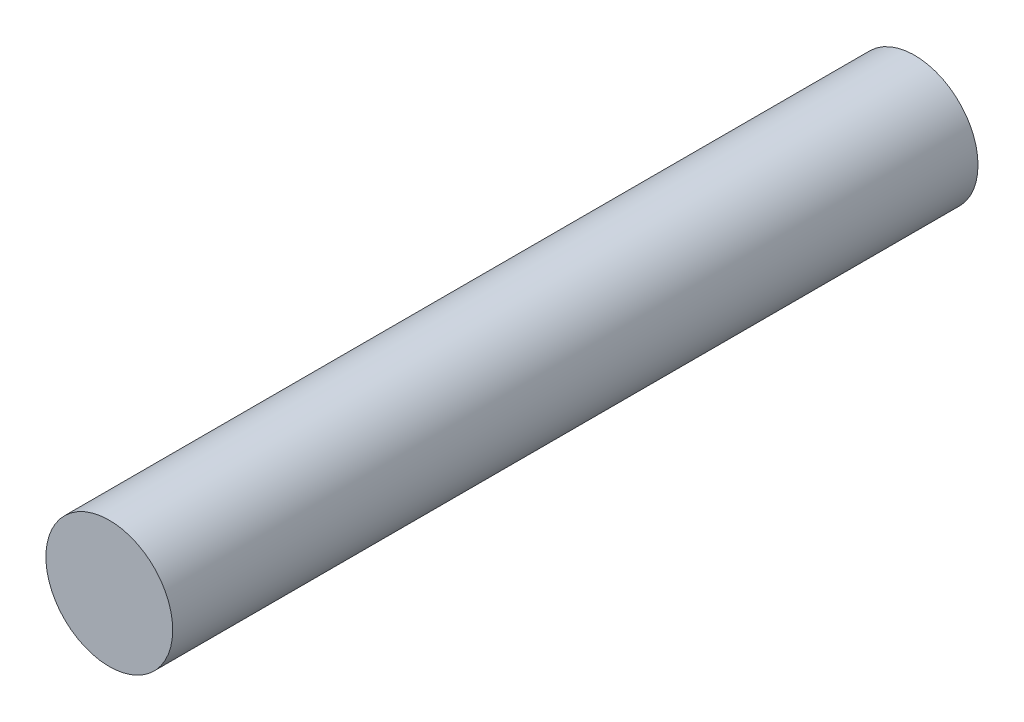
ISO-10303-21;
HEADER;
FILE_DESCRIPTION(('STEP AP214'),'2;1');
FILE_NAME('part.step','',(''),(''),'','','');
FILE_SCHEMA(('AUTOMOTIVE_DESIGN { 1 0 10303 214 1 1 1 1 }'));
ENDSEC;
DATA;
#1=APPLICATION_CONTEXT('core data for automotive mechanical design processes');
#2=APPLICATION_PROTOCOL_DEFINITION('international standard','automotive_design',2000,#1);
#3=PRODUCT_CONTEXT('',#1,'mechanical');
#4=PRODUCT('Part','Part','',(#3));
#5=PRODUCT_RELATED_PRODUCT_CATEGORY('part','',(#4));
#6=PRODUCT_DEFINITION_FORMATION('','',#4);
#7=PRODUCT_DEFINITION_CONTEXT('part definition',#1,'design');
#8=PRODUCT_DEFINITION('design','',#6,#7);
#9=PRODUCT_DEFINITION_SHAPE('','',#8);
#10=(LENGTH_UNIT() NAMED_UNIT(*) SI_UNIT(.MILLI.,.METRE.));
#11=(NAMED_UNIT(*) PLANE_ANGLE_UNIT() SI_UNIT($,.RADIAN.));
#12=(NAMED_UNIT(*) SI_UNIT($,.STERADIAN.) SOLID_ANGLE_UNIT());
#13=UNCERTAINTY_MEASURE_WITH_UNIT(LENGTH_MEASURE(1.E-05),#10,'distance_accuracy_value','');
#14=(GEOMETRIC_REPRESENTATION_CONTEXT(3) GLOBAL_UNCERTAINTY_ASSIGNED_CONTEXT((#13)) GLOBAL_UNIT_ASSIGNED_CONTEXT((#10,
#11,#12)) REPRESENTATION_CONTEXT('',''));
#15=CARTESIAN_POINT('',(0.,0.,0.));
#16=DIRECTION('',(0.,0.,1.));
#17=DIRECTION('',(1.,0.,0.));
#18=AXIS2_PLACEMENT_3D('',#15,#16,#17);
#19=CARTESIAN_POINT('',(0.,0.,50.8));
#20=DIRECTION('',(0.,0.,-1.));
#21=DIRECTION('',(-1.,0.,0.));
#22=AXIS2_PLACEMENT_3D('',#19,#20,#21);
#23=CYLINDRICAL_SURFACE('',#22,4.);
#24=CARTESIAN_POINT('',(0.,0.,50.8));
#25=DIRECTION('',(0.,0.,1.));
#26=DIRECTION('',(1.,0.,0.));
#27=AXIS2_PLACEMENT_3D('',#24,#25,#26);
#28=CIRCLE('',#27,4.);
#29=CARTESIAN_POINT('',(4.,0.,50.8));
#30=VERTEX_POINT('',#29);
#31=EDGE_CURVE('E10',#30,#30,#28,.T.);
#32=ORIENTED_EDGE('',*,*,#31,.F.);
#33=EDGE_LOOP('',(#32));
#34=FACE_BOUND('',#33,.T.);
#35=CARTESIAN_POINT('',(0.,0.,0.));
#36=DIRECTION('',(0.,0.,1.));
#37=DIRECTION('',(1.,0.,0.));
#38=AXIS2_PLACEMENT_3D('',#35,#36,#37);
#39=CIRCLE('',#38,4.);
#40=CARTESIAN_POINT('',(4.,0.,0.));
#41=VERTEX_POINT('',#40);
#42=EDGE_CURVE('E33',#41,#41,#39,.T.);
#43=ORIENTED_EDGE('',*,*,#42,.T.);
#44=EDGE_LOOP('',(#43));
#45=FACE_BOUND('',#44,.T.);
#46=ADVANCED_FACE('F30',(#34,#45),#23,.T.);
#47=CARTESIAN_POINT('',(0.,0.,50.8));
#48=DIRECTION('',(0.,0.,1.));
#49=DIRECTION('',(1.,0.,0.));
#50=AXIS2_PLACEMENT_3D('',#47,#48,#49);
#51=PLANE('',#50);
#52=ORIENTED_EDGE('',*,*,#31,.T.);
#53=EDGE_LOOP('',(#52));
#54=FACE_BOUND('',#53,.T.);
#55=ADVANCED_FACE('F45',(#54),#51,.T.);
#56=CARTESIAN_POINT('',(0.,0.,0.));
#57=DIRECTION('',(0.,0.,1.));
#58=DIRECTION('',(1.,0.,0.));
#59=AXIS2_PLACEMENT_3D('',#56,#57,#58);
#60=PLANE('',#59);
#61=ORIENTED_EDGE('',*,*,#42,.F.);
#62=EDGE_LOOP('',(#61));
#63=FACE_BOUND('',#62,.T.);
#64=ADVANCED_FACE('F43',(#63),#60,.F.);
#65=CLOSED_SHELL('',(#46,#55,#64));
#66=MANIFOLD_SOLID_BREP('B2',#65);
#67=ADVANCED_BREP_SHAPE_REPRESENTATION('',(#18,#66),#14);
#68=SHAPE_DEFINITION_REPRESENTATION(#9,#67);
ENDSEC;
END-ISO-10303-21;
